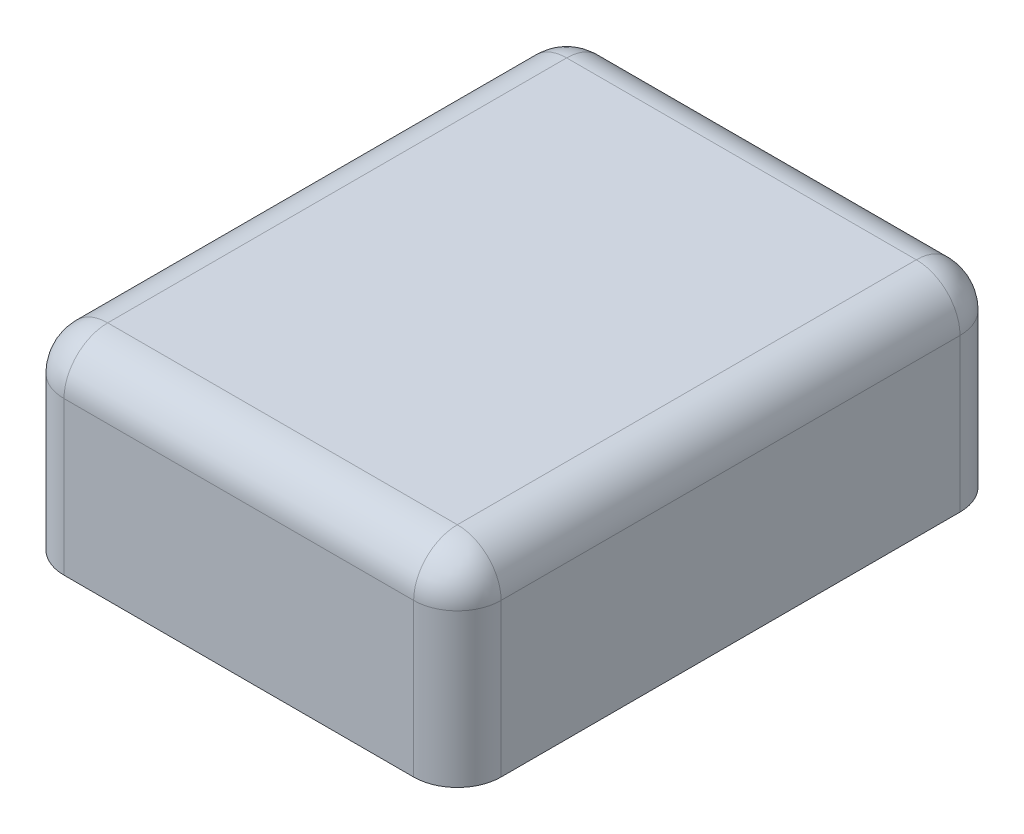
ISO-10303-21;
HEADER;
FILE_DESCRIPTION(('STEP AP214'),'2;1');
FILE_NAME('part.step','',(''),(''),'','','');
FILE_SCHEMA(('AUTOMOTIVE_DESIGN { 1 0 10303 214 1 1 1 1 }'));
ENDSEC;
DATA;
#1=APPLICATION_CONTEXT('core data for automotive mechanical design processes');
#2=APPLICATION_PROTOCOL_DEFINITION('international standard','automotive_design',2000,#1);
#3=PRODUCT_CONTEXT('',#1,'mechanical');
#4=PRODUCT('Part','Part','',(#3));
#5=PRODUCT_RELATED_PRODUCT_CATEGORY('part','',(#4));
#6=PRODUCT_DEFINITION_FORMATION('','',#4);
#7=PRODUCT_DEFINITION_CONTEXT('part definition',#1,'design');
#8=PRODUCT_DEFINITION('design','',#6,#7);
#9=PRODUCT_DEFINITION_SHAPE('','',#8);
#10=(LENGTH_UNIT() NAMED_UNIT(*) SI_UNIT(.MILLI.,.METRE.));
#11=(NAMED_UNIT(*) PLANE_ANGLE_UNIT() SI_UNIT($,.RADIAN.));
#12=(NAMED_UNIT(*) SI_UNIT($,.STERADIAN.) SOLID_ANGLE_UNIT());
#13=UNCERTAINTY_MEASURE_WITH_UNIT(LENGTH_MEASURE(1.E-05),#10,'distance_accuracy_value','');
#14=(GEOMETRIC_REPRESENTATION_CONTEXT(3) GLOBAL_UNCERTAINTY_ASSIGNED_CONTEXT((#13)) GLOBAL_UNIT_ASSIGNED_CONTEXT((#10,
#11,#12)) REPRESENTATION_CONTEXT('',''));
#15=CARTESIAN_POINT('',(0.,0.,0.));
#16=DIRECTION('',(0.,0.,1.));
#17=DIRECTION('',(1.,0.,0.));
#18=AXIS2_PLACEMENT_3D('',#15,#16,#17);
#19=CARTESIAN_POINT('',(1.,0.9,-1.25));
#20=DIRECTION('',(-1.,0.,0.));
#21=DIRECTION('',(0.,0.,1.));
#22=AXIS2_PLACEMENT_3D('',#19,#20,#21);
#23=PLANE('',#22);
#24=DIRECTION('',(0.,-1.,0.));
#25=VECTOR('',#24,1.);
#26=CARTESIAN_POINT('',(1.,0.9,-1.05));
#27=LINE('',#26,#25);
#28=CARTESIAN_POINT('',(1.,0.,-1.05));
#29=VERTEX_POINT('',#28);
#30=CARTESIAN_POINT('',(1.,0.7,-1.05));
#31=VERTEX_POINT('',#30);
#32=EDGE_CURVE('E120',#29,#31,#27,.F.);
#33=ORIENTED_EDGE('',*,*,#32,.T.);
#34=DIRECTION('',(0.,0.,-1.));
#35=VECTOR('',#34,1.);
#36=CARTESIAN_POINT('',(1.,0.7,1.05));
#37=LINE('',#36,#35);
#38=CARTESIAN_POINT('',(1.,0.7,1.05));
#39=VERTEX_POINT('',#38);
#40=EDGE_CURVE('E60',#31,#39,#37,.F.);
#41=ORIENTED_EDGE('',*,*,#40,.T.);
#42=DIRECTION('',(0.,-1.,0.));
#43=VECTOR('',#42,1.);
#44=CARTESIAN_POINT('',(1.,0.9,1.05));
#45=LINE('',#44,#43);
#46=CARTESIAN_POINT('',(1.,0.,1.05));
#47=VERTEX_POINT('',#46);
#48=EDGE_CURVE('E113',#39,#47,#45,.T.);
#49=ORIENTED_EDGE('',*,*,#48,.T.);
#50=DIRECTION('',(0.,0.,-1.));
#51=VECTOR('',#50,1.);
#52=CARTESIAN_POINT('',(1.,0.,-1.25));
#53=LINE('',#52,#51);
#54=EDGE_CURVE('E116',#47,#29,#53,.T.);
#55=ORIENTED_EDGE('',*,*,#54,.T.);
#56=EDGE_LOOP('',(#33,#41,#49,#55));
#57=FACE_BOUND('',#56,.T.);
#58=ADVANCED_FACE('F36',(#57),#23,.F.);
#59=CARTESIAN_POINT('',(-1.,0.9,-1.25));
#60=DIRECTION('',(0.,0.,1.));
#61=DIRECTION('',(1.,0.,0.));
#62=AXIS2_PLACEMENT_3D('',#59,#60,#61);
#63=PLANE('',#62);
#64=DIRECTION('',(0.,-1.,0.));
#65=VECTOR('',#64,1.);
#66=CARTESIAN_POINT('',(-0.8,0.9,-1.25));
#67=LINE('',#66,#65);
#68=CARTESIAN_POINT('',(-0.8,0.,-1.25));
#69=VERTEX_POINT('',#68);
#70=CARTESIAN_POINT('',(-0.8,0.7,-1.25));
#71=VERTEX_POINT('',#70);
#72=EDGE_CURVE('E153',#69,#71,#67,.F.);
#73=ORIENTED_EDGE('',*,*,#72,.T.);
#74=DIRECTION('',(-1.,0.,0.));
#75=VECTOR('',#74,1.);
#76=CARTESIAN_POINT('',(0.8,0.7,-1.25));
#77=LINE('',#76,#75);
#78=CARTESIAN_POINT('',(0.8,0.7,-1.25));
#79=VERTEX_POINT('',#78);
#80=EDGE_CURVE('E179',#71,#79,#77,.F.);
#81=ORIENTED_EDGE('',*,*,#80,.T.);
#82=DIRECTION('',(0.,-1.,0.));
#83=VECTOR('',#82,1.);
#84=CARTESIAN_POINT('',(0.8,0.9,-1.25));
#85=LINE('',#84,#83);
#86=CARTESIAN_POINT('',(0.8,0.,-1.25));
#87=VERTEX_POINT('',#86);
#88=EDGE_CURVE('E156',#79,#87,#85,.T.);
#89=ORIENTED_EDGE('',*,*,#88,.T.);
#90=DIRECTION('',(-1.,0.,0.));
#91=VECTOR('',#90,1.);
#92=CARTESIAN_POINT('',(-1.,0.,-1.25));
#93=LINE('',#92,#91);
#94=EDGE_CURVE('E134',#87,#69,#93,.T.);
#95=ORIENTED_EDGE('',*,*,#94,.T.);
#96=EDGE_LOOP('',(#73,#81,#89,#95));
#97=FACE_BOUND('',#96,.T.);
#98=ADVANCED_FACE('F238',(#97),#63,.F.);
#99=CARTESIAN_POINT('',(-1.,0.9,-1.25));
#100=DIRECTION('',(1.,0.,0.));
#101=DIRECTION('',(0.,0.,-1.));
#102=AXIS2_PLACEMENT_3D('',#99,#100,#101);
#103=PLANE('',#102);
#104=DIRECTION('',(0.,-1.,0.));
#105=VECTOR('',#104,1.);
#106=CARTESIAN_POINT('',(-1.,0.9,1.05));
#107=LINE('',#106,#105);
#108=CARTESIAN_POINT('',(-1.,0.,1.05));
#109=VERTEX_POINT('',#108);
#110=CARTESIAN_POINT('',(-1.,0.7,1.05));
#111=VERTEX_POINT('',#110);
#112=EDGE_CURVE('E160',#109,#111,#107,.F.);
#113=ORIENTED_EDGE('',*,*,#112,.T.);
#114=DIRECTION('',(0.,0.,1.));
#115=VECTOR('',#114,1.);
#116=CARTESIAN_POINT('',(-1.,0.7,-1.05));
#117=LINE('',#116,#115);
#118=CARTESIAN_POINT('',(-1.,0.7,-1.05));
#119=VERTEX_POINT('',#118);
#120=EDGE_CURVE('E175',#111,#119,#117,.F.);
#121=ORIENTED_EDGE('',*,*,#120,.T.);
#122=DIRECTION('',(0.,-1.,0.));
#123=VECTOR('',#122,1.);
#124=CARTESIAN_POINT('',(-1.,0.9,-1.05));
#125=LINE('',#124,#123);
#126=CARTESIAN_POINT('',(-1.,0.,-1.05));
#127=VERTEX_POINT('',#126);
#128=EDGE_CURVE('E158',#119,#127,#125,.T.);
#129=ORIENTED_EDGE('',*,*,#128,.T.);
#130=DIRECTION('',(0.,0.,1.));
#131=VECTOR('',#130,1.);
#132=CARTESIAN_POINT('',(-1.,0.,-1.25));
#133=LINE('',#132,#131);
#134=EDGE_CURVE('E137',#127,#109,#133,.T.);
#135=ORIENTED_EDGE('',*,*,#134,.T.);
#136=EDGE_LOOP('',(#113,#121,#129,#135));
#137=FACE_BOUND('',#136,.T.);
#138=ADVANCED_FACE('F243',(#137),#103,.F.);
#139=CARTESIAN_POINT('',(-1.,0.9,1.25));
#140=DIRECTION('',(0.,0.,-1.));
#141=DIRECTION('',(-1.,0.,0.));
#142=AXIS2_PLACEMENT_3D('',#139,#140,#141);
#143=PLANE('',#142);
#144=DIRECTION('',(0.,-1.,0.));
#145=VECTOR('',#144,1.);
#146=CARTESIAN_POINT('',(0.800000000000001,0.9,1.25));
#147=LINE('',#146,#145);
#148=CARTESIAN_POINT('',(0.800000000000001,0.,1.25));
#149=VERTEX_POINT('',#148);
#150=CARTESIAN_POINT('',(0.800000000000001,0.7,1.25));
#151=VERTEX_POINT('',#150);
#152=EDGE_CURVE('E124',#149,#151,#147,.F.);
#153=ORIENTED_EDGE('',*,*,#152,.T.);
#154=DIRECTION('',(1.,0.,0.));
#155=VECTOR('',#154,1.);
#156=CARTESIAN_POINT('',(-0.8,0.7,1.25));
#157=LINE('',#156,#155);
#158=CARTESIAN_POINT('',(-0.8,0.7,1.25));
#159=VERTEX_POINT('',#158);
#160=EDGE_CURVE('E11',#151,#159,#157,.F.);
#161=ORIENTED_EDGE('',*,*,#160,.T.);
#162=DIRECTION('',(0.,-1.,0.));
#163=VECTOR('',#162,1.);
#164=CARTESIAN_POINT('',(-0.8,0.9,1.25));
#165=LINE('',#164,#163);
#166=CARTESIAN_POINT('',(-0.8,0.,1.25));
#167=VERTEX_POINT('',#166);
#168=EDGE_CURVE('E128',#159,#167,#165,.T.);
#169=ORIENTED_EDGE('',*,*,#168,.T.);
#170=DIRECTION('',(1.,0.,0.));
#171=VECTOR('',#170,1.);
#172=CARTESIAN_POINT('',(-1.,0.,1.25));
#173=LINE('',#172,#171);
#174=EDGE_CURVE('E144',#167,#149,#173,.T.);
#175=ORIENTED_EDGE('',*,*,#174,.T.);
#176=EDGE_LOOP('',(#153,#161,#169,#175));
#177=FACE_BOUND('',#176,.T.);
#178=ADVANCED_FACE('F354',(#177),#143,.F.);
#179=CARTESIAN_POINT('',(0.,0.9,0.));
#180=DIRECTION('',(0.,1.,0.));
#181=DIRECTION('',(0.,0.,1.));
#182=AXIS2_PLACEMENT_3D('',#179,#180,#181);
#183=PLANE('',#182);
#184=DIRECTION('',(-1.,0.,0.));
#185=VECTOR('',#184,1.);
#186=CARTESIAN_POINT('',(-0.8,0.9,-1.05));
#187=LINE('',#186,#185);
#188=CARTESIAN_POINT('',(0.8,0.9,-1.05));
#189=VERTEX_POINT('',#188);
#190=CARTESIAN_POINT('',(-0.8,0.9,-1.05));
#191=VERTEX_POINT('',#190);
#192=EDGE_CURVE('E170',#189,#191,#187,.T.);
#193=ORIENTED_EDGE('',*,*,#192,.T.);
#194=DIRECTION('',(0.,0.,1.));
#195=VECTOR('',#194,1.);
#196=CARTESIAN_POINT('',(-0.8,0.9,1.05));
#197=LINE('',#196,#195);
#198=CARTESIAN_POINT('',(-0.8,0.9,1.05));
#199=VERTEX_POINT('',#198);
#200=EDGE_CURVE('E172',#191,#199,#197,.T.);
#201=ORIENTED_EDGE('',*,*,#200,.T.);
#202=DIRECTION('',(1.,0.,0.));
#203=VECTOR('',#202,1.);
#204=CARTESIAN_POINT('',(0.800000000000001,0.9,1.05));
#205=LINE('',#204,#203);
#206=CARTESIAN_POINT('',(0.8,0.9,1.05));
#207=VERTEX_POINT('',#206);
#208=EDGE_CURVE('E166',#199,#207,#205,.T.);
#209=ORIENTED_EDGE('',*,*,#208,.T.);
#210=DIRECTION('',(0.,0.,-1.));
#211=VECTOR('',#210,1.);
#212=CARTESIAN_POINT('',(0.8,0.9,-1.05));
#213=LINE('',#212,#211);
#214=EDGE_CURVE('E168',#207,#189,#213,.T.);
#215=ORIENTED_EDGE('',*,*,#214,.T.);
#216=EDGE_LOOP('',(#193,#201,#209,#215));
#217=FACE_BOUND('',#216,.T.);
#218=ADVANCED_FACE('F215',(#217),#183,.T.);
#219=CARTESIAN_POINT('',(0.,0.,0.));
#220=DIRECTION('',(0.,1.,0.));
#221=DIRECTION('',(0.,0.,1.));
#222=AXIS2_PLACEMENT_3D('',#219,#220,#221);
#223=PLANE('',#222);
#224=ORIENTED_EDGE('',*,*,#54,.F.);
#225=CARTESIAN_POINT('',(0.8,0.,1.05));
#226=DIRECTION('',(0.,1.,0.));
#227=DIRECTION('',(0.,0.,1.));
#228=AXIS2_PLACEMENT_3D('',#225,#226,#227);
#229=CIRCLE('',#228,0.2);
#230=EDGE_CURVE('E122',#47,#149,#229,.F.);
#231=ORIENTED_EDGE('',*,*,#230,.T.);
#232=ORIENTED_EDGE('',*,*,#174,.F.);
#233=CARTESIAN_POINT('',(-0.8,0.,1.05));
#234=DIRECTION('',(0.,1.,0.));
#235=DIRECTION('',(0.,0.,1.));
#236=AXIS2_PLACEMENT_3D('',#233,#234,#235);
#237=CIRCLE('',#236,0.2);
#238=EDGE_CURVE('E148',#167,#109,#237,.F.);
#239=ORIENTED_EDGE('',*,*,#238,.T.);
#240=ORIENTED_EDGE('',*,*,#134,.F.);
#241=CARTESIAN_POINT('',(-0.8,0.,-1.05));
#242=DIRECTION('',(0.,1.,0.));
#243=DIRECTION('',(0.,0.,1.));
#244=AXIS2_PLACEMENT_3D('',#241,#242,#243);
#245=CIRCLE('',#244,0.2);
#246=EDGE_CURVE('E119',#127,#69,#245,.F.);
#247=ORIENTED_EDGE('',*,*,#246,.T.);
#248=ORIENTED_EDGE('',*,*,#94,.F.);
#249=CARTESIAN_POINT('',(0.8,0.,-1.05));
#250=DIRECTION('',(0.,1.,0.));
#251=DIRECTION('',(0.,0.,1.));
#252=AXIS2_PLACEMENT_3D('',#249,#250,#251);
#253=CIRCLE('',#252,0.2);
#254=EDGE_CURVE('E129',#87,#29,#253,.F.);
#255=ORIENTED_EDGE('',*,*,#254,.T.);
#256=EDGE_LOOP('',(#224,#231,#232,#239,#240,#247,#248,#255));
#257=FACE_BOUND('',#256,.T.);
#258=ADVANCED_FACE('F131',(#257),#223,.F.);
#259=CARTESIAN_POINT('',(0.8,0.9,1.05));
#260=DIRECTION('',(0.,-1.,0.));
#261=DIRECTION('',(0.,0.,-1.));
#262=AXIS2_PLACEMENT_3D('',#259,#260,#261);
#263=CYLINDRICAL_SURFACE('',#262,0.2);
#264=ORIENTED_EDGE('',*,*,#48,.F.);
#265=CARTESIAN_POINT('',(0.8,0.7,1.05));
#266=DIRECTION('',(0.,-1.,0.));
#267=DIRECTION('',(0.,0.,-1.));
#268=AXIS2_PLACEMENT_3D('',#265,#266,#267);
#269=CIRCLE('',#268,0.2);
#270=EDGE_CURVE('E45',#39,#151,#269,.T.);
#271=ORIENTED_EDGE('',*,*,#270,.T.);
#272=ORIENTED_EDGE('',*,*,#152,.F.);
#273=ORIENTED_EDGE('',*,*,#230,.F.);
#274=EDGE_LOOP('',(#264,#271,#272,#273));
#275=FACE_BOUND('',#274,.T.);
#276=ADVANCED_FACE('F123',(#275),#263,.T.);
#277=CARTESIAN_POINT('',(0.8,0.9,-1.05));
#278=DIRECTION('',(0.,-1.,0.));
#279=DIRECTION('',(0.,0.,-1.));
#280=AXIS2_PLACEMENT_3D('',#277,#278,#279);
#281=CYLINDRICAL_SURFACE('',#280,0.2);
#282=ORIENTED_EDGE('',*,*,#88,.F.);
#283=CARTESIAN_POINT('',(0.8,0.7,-1.05));
#284=DIRECTION('',(0.,-1.,0.));
#285=DIRECTION('',(0.,0.,-1.));
#286=AXIS2_PLACEMENT_3D('',#283,#284,#285);
#287=CIRCLE('',#286,0.2);
#288=EDGE_CURVE('E181',#79,#31,#287,.T.);
#289=ORIENTED_EDGE('',*,*,#288,.T.);
#290=ORIENTED_EDGE('',*,*,#32,.F.);
#291=ORIENTED_EDGE('',*,*,#254,.F.);
#292=EDGE_LOOP('',(#282,#289,#290,#291));
#293=FACE_BOUND('',#292,.T.);
#294=ADVANCED_FACE('F250',(#293),#281,.T.);
#295=CARTESIAN_POINT('',(-0.8,0.9,1.05));
#296=DIRECTION('',(0.,-1.,0.));
#297=DIRECTION('',(0.,0.,-1.));
#298=AXIS2_PLACEMENT_3D('',#295,#296,#297);
#299=CYLINDRICAL_SURFACE('',#298,0.2);
#300=ORIENTED_EDGE('',*,*,#168,.F.);
#301=CARTESIAN_POINT('',(-0.8,0.7,1.05));
#302=DIRECTION('',(0.,-1.,0.));
#303=DIRECTION('',(0.,0.,-1.));
#304=AXIS2_PLACEMENT_3D('',#301,#302,#303);
#305=CIRCLE('',#304,0.2);
#306=EDGE_CURVE('E163',#159,#111,#305,.T.);
#307=ORIENTED_EDGE('',*,*,#306,.T.);
#308=ORIENTED_EDGE('',*,*,#112,.F.);
#309=ORIENTED_EDGE('',*,*,#238,.F.);
#310=EDGE_LOOP('',(#300,#307,#308,#309));
#311=FACE_BOUND('',#310,.T.);
#312=ADVANCED_FACE('F253',(#311),#299,.T.);
#313=CARTESIAN_POINT('',(-0.8,0.9,-1.05));
#314=DIRECTION('',(0.,-1.,0.));
#315=DIRECTION('',(0.,0.,-1.));
#316=AXIS2_PLACEMENT_3D('',#313,#314,#315);
#317=CYLINDRICAL_SURFACE('',#316,0.2);
#318=ORIENTED_EDGE('',*,*,#128,.F.);
#319=CARTESIAN_POINT('',(-0.8,0.7,-1.05));
#320=DIRECTION('',(0.,-1.,0.));
#321=DIRECTION('',(0.,0.,-1.));
#322=AXIS2_PLACEMENT_3D('',#319,#320,#321);
#323=CIRCLE('',#322,0.2);
#324=EDGE_CURVE('E177',#119,#71,#323,.T.);
#325=ORIENTED_EDGE('',*,*,#324,.T.);
#326=ORIENTED_EDGE('',*,*,#72,.F.);
#327=ORIENTED_EDGE('',*,*,#246,.F.);
#328=EDGE_LOOP('',(#318,#325,#326,#327));
#329=FACE_BOUND('',#328,.T.);
#330=ADVANCED_FACE('F257',(#329),#317,.T.);
#331=CARTESIAN_POINT('',(0.8,0.7,-1.05));
#332=DIRECTION('',(0.,1.,0.));
#333=DIRECTION('',(0.,0.,1.));
#334=AXIS2_PLACEMENT_3D('',#331,#332,#333);
#335=SPHERICAL_SURFACE('',#334,0.2);
#336=CARTESIAN_POINT('',(0.8,0.7,-1.05));
#337=DIRECTION('',(0.,0.,1.));
#338=DIRECTION('',(1.,0.,0.));
#339=AXIS2_PLACEMENT_3D('',#336,#337,#338);
#340=CIRCLE('',#339,0.2);
#341=EDGE_CURVE('E140',#31,#189,#340,.T.);
#342=ORIENTED_EDGE('',*,*,#341,.F.);
#343=ORIENTED_EDGE('',*,*,#288,.F.);
#344=CARTESIAN_POINT('',(0.8,0.7,-1.05));
#345=DIRECTION('',(-1.,0.,0.));
#346=DIRECTION('',(0.,0.,1.));
#347=AXIS2_PLACEMENT_3D('',#344,#345,#346);
#348=CIRCLE('',#347,0.2);
#349=EDGE_CURVE('E40',#189,#79,#348,.T.);
#350=ORIENTED_EDGE('',*,*,#349,.F.);
#351=EDGE_LOOP('',(#342,#343,#350));
#352=FACE_BOUND('',#351,.T.);
#353=ADVANCED_FACE('F38',(#352),#335,.T.);
#354=CARTESIAN_POINT('',(0.,0.7,-1.05));
#355=DIRECTION('',(1.,0.,0.));
#356=DIRECTION('',(0.,0.,-1.));
#357=AXIS2_PLACEMENT_3D('',#354,#355,#356);
#358=CYLINDRICAL_SURFACE('',#357,0.2);
#359=ORIENTED_EDGE('',*,*,#349,.T.);
#360=ORIENTED_EDGE('',*,*,#80,.F.);
#361=CARTESIAN_POINT('',(-0.8,0.7,-1.05));
#362=DIRECTION('',(-1.,0.,0.));
#363=DIRECTION('',(0.,0.,1.));
#364=AXIS2_PLACEMENT_3D('',#361,#362,#363);
#365=CIRCLE('',#364,0.2);
#366=EDGE_CURVE('E198',#191,#71,#365,.T.);
#367=ORIENTED_EDGE('',*,*,#366,.F.);
#368=ORIENTED_EDGE('',*,*,#192,.F.);
#369=EDGE_LOOP('',(#359,#360,#367,#368));
#370=FACE_BOUND('',#369,.T.);
#371=ADVANCED_FACE('F212',(#370),#358,.T.);
#372=CARTESIAN_POINT('',(0.8,0.7,0.));
#373=DIRECTION('',(0.,0.,1.));
#374=DIRECTION('',(1.,0.,0.));
#375=AXIS2_PLACEMENT_3D('',#372,#373,#374);
#376=CYLINDRICAL_SURFACE('',#375,0.2);
#377=ORIENTED_EDGE('',*,*,#341,.T.);
#378=ORIENTED_EDGE('',*,*,#214,.F.);
#379=CARTESIAN_POINT('',(0.8,0.7,1.05));
#380=DIRECTION('',(0.,0.,1.));
#381=DIRECTION('',(1.,0.,0.));
#382=AXIS2_PLACEMENT_3D('',#379,#380,#381);
#383=CIRCLE('',#382,0.2);
#384=EDGE_CURVE('E195',#39,#207,#383,.T.);
#385=ORIENTED_EDGE('',*,*,#384,.F.);
#386=ORIENTED_EDGE('',*,*,#40,.F.);
#387=EDGE_LOOP('',(#377,#378,#385,#386));
#388=FACE_BOUND('',#387,.T.);
#389=ADVANCED_FACE('F205',(#388),#376,.T.);
#390=CARTESIAN_POINT('',(-0.8,0.7,-1.05));
#391=DIRECTION('',(0.,1.,0.));
#392=DIRECTION('',(0.,0.,1.));
#393=AXIS2_PLACEMENT_3D('',#390,#391,#392);
#394=SPHERICAL_SURFACE('',#393,0.2);
#395=ORIENTED_EDGE('',*,*,#366,.T.);
#396=ORIENTED_EDGE('',*,*,#324,.F.);
#397=CARTESIAN_POINT('',(-0.8,0.7,-1.05));
#398=DIRECTION('',(0.,0.,1.));
#399=DIRECTION('',(1.,0.,0.));
#400=AXIS2_PLACEMENT_3D('',#397,#398,#399);
#401=CIRCLE('',#400,0.2);
#402=EDGE_CURVE('E192',#191,#119,#401,.T.);
#403=ORIENTED_EDGE('',*,*,#402,.F.);
#404=EDGE_LOOP('',(#395,#396,#403));
#405=FACE_BOUND('',#404,.T.);
#406=ADVANCED_FACE('F227',(#405),#394,.T.);
#407=CARTESIAN_POINT('',(0.8,0.7,1.05));
#408=DIRECTION('',(0.,1.,0.));
#409=DIRECTION('',(0.,0.,1.));
#410=AXIS2_PLACEMENT_3D('',#407,#408,#409);
#411=SPHERICAL_SURFACE('',#410,0.2);
#412=ORIENTED_EDGE('',*,*,#270,.F.);
#413=ORIENTED_EDGE('',*,*,#384,.T.);
#414=CARTESIAN_POINT('',(0.8,0.7,1.05));
#415=DIRECTION('',(-1.,0.,0.));
#416=DIRECTION('',(0.,0.,1.));
#417=AXIS2_PLACEMENT_3D('',#414,#415,#416);
#418=CIRCLE('',#417,0.2);
#419=EDGE_CURVE('E189',#151,#207,#418,.T.);
#420=ORIENTED_EDGE('',*,*,#419,.F.);
#421=EDGE_LOOP('',(#412,#413,#420));
#422=FACE_BOUND('',#421,.T.);
#423=ADVANCED_FACE('F224',(#422),#411,.T.);
#424=CARTESIAN_POINT('',(-0.8,0.7,0.));
#425=DIRECTION('',(0.,0.,-1.));
#426=DIRECTION('',(-1.,0.,0.));
#427=AXIS2_PLACEMENT_3D('',#424,#425,#426);
#428=CYLINDRICAL_SURFACE('',#427,0.2);
#429=ORIENTED_EDGE('',*,*,#402,.T.);
#430=ORIENTED_EDGE('',*,*,#120,.F.);
#431=CARTESIAN_POINT('',(-0.8,0.7,1.05));
#432=DIRECTION('',(0.,0.,1.));
#433=DIRECTION('',(1.,0.,0.));
#434=AXIS2_PLACEMENT_3D('',#431,#432,#433);
#435=CIRCLE('',#434,0.2);
#436=EDGE_CURVE('E187',#199,#111,#435,.T.);
#437=ORIENTED_EDGE('',*,*,#436,.F.);
#438=ORIENTED_EDGE('',*,*,#200,.F.);
#439=EDGE_LOOP('',(#429,#430,#437,#438));
#440=FACE_BOUND('',#439,.T.);
#441=ADVANCED_FACE('F226',(#440),#428,.T.);
#442=CARTESIAN_POINT('',(0.,0.7,1.05));
#443=DIRECTION('',(-1.,0.,0.));
#444=DIRECTION('',(0.,0.,1.));
#445=AXIS2_PLACEMENT_3D('',#442,#443,#444);
#446=CYLINDRICAL_SURFACE('',#445,0.2);
#447=ORIENTED_EDGE('',*,*,#419,.T.);
#448=ORIENTED_EDGE('',*,*,#208,.F.);
#449=CARTESIAN_POINT('',(-0.8,0.7,1.05));
#450=DIRECTION('',(-1.,0.,0.));
#451=DIRECTION('',(0.,0.,1.));
#452=AXIS2_PLACEMENT_3D('',#449,#450,#451);
#453=CIRCLE('',#452,0.2);
#454=EDGE_CURVE('E185',#159,#199,#453,.T.);
#455=ORIENTED_EDGE('',*,*,#454,.F.);
#456=ORIENTED_EDGE('',*,*,#160,.F.);
#457=EDGE_LOOP('',(#447,#448,#455,#456));
#458=FACE_BOUND('',#457,.T.);
#459=ADVANCED_FACE('F220',(#458),#446,.T.);
#460=CARTESIAN_POINT('',(-0.8,0.7,1.05));
#461=DIRECTION('',(0.,1.,0.));
#462=DIRECTION('',(0.,0.,1.));
#463=AXIS2_PLACEMENT_3D('',#460,#461,#462);
#464=SPHERICAL_SURFACE('',#463,0.2);
#465=ORIENTED_EDGE('',*,*,#436,.T.);
#466=ORIENTED_EDGE('',*,*,#306,.F.);
#467=ORIENTED_EDGE('',*,*,#454,.T.);
#468=EDGE_LOOP('',(#465,#466,#467));
#469=FACE_BOUND('',#468,.T.);
#470=ADVANCED_FACE('F262',(#469),#464,.T.);
#471=CLOSED_SHELL('',(#58,#98,#138,#178,#218,#258,#276,#294,#312,#330,#353,#371,#389,#406,#423,
#441,#459,#470));
#472=MANIFOLD_SOLID_BREP('B2',#471);
#473=ADVANCED_BREP_SHAPE_REPRESENTATION('',(#18,#472),#14);
#474=SHAPE_DEFINITION_REPRESENTATION(#9,#473);
ENDSEC;
END-ISO-10303-21;
